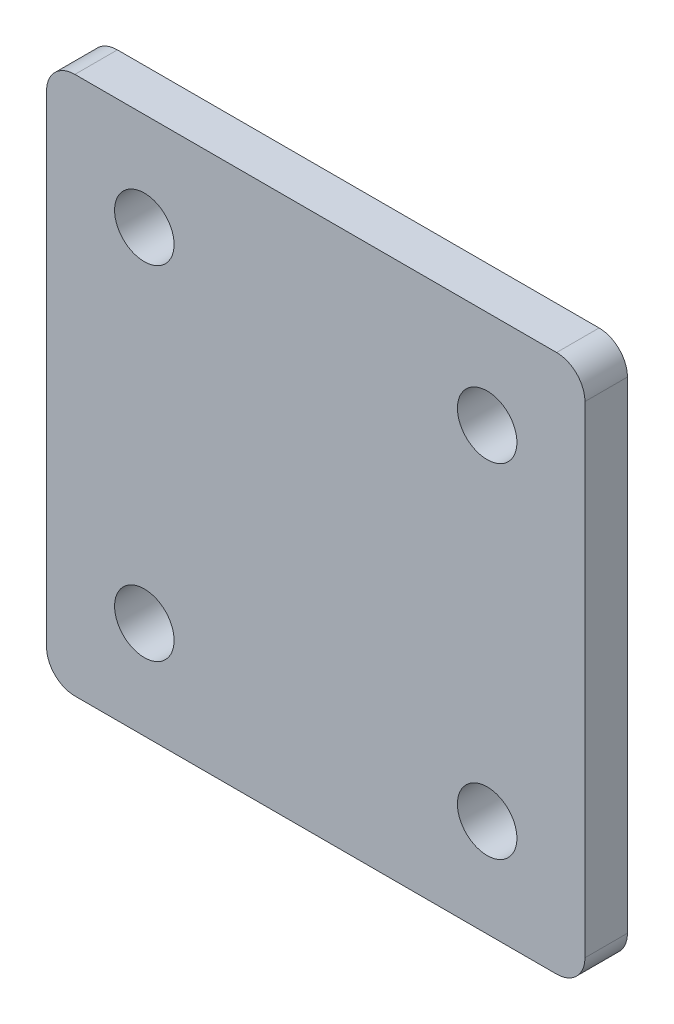
ISO-10303-21;
HEADER;
FILE_DESCRIPTION(('STEP AP214'),'2;1');
FILE_NAME('part.step','',(''),(''),'','','');
FILE_SCHEMA(('AUTOMOTIVE_DESIGN { 1 0 10303 214 1 1 1 1 }'));
ENDSEC;
DATA;
#1=APPLICATION_CONTEXT('core data for automotive mechanical design processes');
#2=APPLICATION_PROTOCOL_DEFINITION('international standard','automotive_design',2000,#1);
#3=PRODUCT_CONTEXT('',#1,'mechanical');
#4=PRODUCT('Part','Part','',(#3));
#5=PRODUCT_RELATED_PRODUCT_CATEGORY('part','',(#4));
#6=PRODUCT_DEFINITION_FORMATION('','',#4);
#7=PRODUCT_DEFINITION_CONTEXT('part definition',#1,'design');
#8=PRODUCT_DEFINITION('design','',#6,#7);
#9=PRODUCT_DEFINITION_SHAPE('','',#8);
#10=(LENGTH_UNIT() NAMED_UNIT(*) SI_UNIT(.MILLI.,.METRE.));
#11=(NAMED_UNIT(*) PLANE_ANGLE_UNIT() SI_UNIT($,.RADIAN.));
#12=(NAMED_UNIT(*) SI_UNIT($,.STERADIAN.) SOLID_ANGLE_UNIT());
#13=UNCERTAINTY_MEASURE_WITH_UNIT(LENGTH_MEASURE(1.E-05),#10,'distance_accuracy_value','');
#14=(GEOMETRIC_REPRESENTATION_CONTEXT(3) GLOBAL_UNCERTAINTY_ASSIGNED_CONTEXT((#13)) GLOBAL_UNIT_ASSIGNED_CONTEXT((#10,
#11,#12)) REPRESENTATION_CONTEXT('',''));
#15=CARTESIAN_POINT('',(0.,0.,0.));
#16=DIRECTION('',(0.,0.,1.));
#17=DIRECTION('',(1.,0.,0.));
#18=AXIS2_PLACEMENT_3D('',#15,#16,#17);
#19=CARTESIAN_POINT('',(95.0000000000001,-94.9999999999997,15.));
#20=DIRECTION('',(1.,0.,0.));
#21=DIRECTION('',(0.,1.,0.));
#22=AXIS2_PLACEMENT_3D('',#19,#20,#21);
#23=PLANE('',#22);
#24=DIRECTION('',(0.,0.,1.00000000000002));
#25=VECTOR('',#24,1.);
#26=CARTESIAN_POINT('',(95.0000000000001,-84.9999999999997,15.));
#27=LINE('',#26,#25);
#28=CARTESIAN_POINT('',(95.0000000000001,-85.0000000000037,1.37794281114435E-12));
#29=VERTEX_POINT('',#28);
#30=CARTESIAN_POINT('',(95.0000000000001,-84.9999999999997,15.));
#31=VERTEX_POINT('',#30);
#32=EDGE_CURVE('E11',#29,#31,#27,.T.);
#33=ORIENTED_EDGE('',*,*,#32,.F.);
#34=DIRECTION('',(0.,1.00000000000002,0.));
#35=VECTOR('',#34,1.);
#36=CARTESIAN_POINT('',(95.0000000000001,0.,-2.40484803003026E-13));
#37=LINE('',#36,#35);
#38=CARTESIAN_POINT('',(95.,85.0000000000037,-1.8589124171504E-12));
#39=VERTEX_POINT('',#38);
#40=EDGE_CURVE('E106',#29,#39,#37,.T.);
#41=ORIENTED_EDGE('',*,*,#40,.T.);
#42=DIRECTION('',(0.,0.,1.00000000000002));
#43=VECTOR('',#42,1.);
#44=CARTESIAN_POINT('',(95.,85.0000000000003,15.));
#45=LINE('',#44,#43);
#46=CARTESIAN_POINT('',(95.,85.0000000000003,15.));
#47=VERTEX_POINT('',#46);
#48=EDGE_CURVE('E47',#39,#47,#45,.T.);
#49=ORIENTED_EDGE('',*,*,#48,.T.);
#50=DIRECTION('',(0.,1.,0.));
#51=VECTOR('',#50,1.);
#52=CARTESIAN_POINT('',(95.0000000000001,-94.9999999999997,15.));
#53=LINE('',#52,#51);
#54=EDGE_CURVE('E154',#31,#47,#53,.T.);
#55=ORIENTED_EDGE('',*,*,#54,.F.);
#56=EDGE_LOOP('',(#33,#41,#49,#55));
#57=FACE_BOUND('',#56,.T.);
#58=ADVANCED_FACE('F37',(#57),#23,.T.);
#59=CARTESIAN_POINT('',(85.0000000000001,85.0000000000003,15.));
#60=DIRECTION('',(0.,0.,1.00000000000002));
#61=DIRECTION('',(0.,-1.,0.));
#62=AXIS2_PLACEMENT_3D('',#59,#60,#61);
#63=CYLINDRICAL_SURFACE('',#62,10.);
#64=ORIENTED_EDGE('',*,*,#48,.F.);
#65=CARTESIAN_POINT('',(85.0000000000001,85.,-9.5062846483529E-13));
#66=DIRECTION('',(0.,0.,1.00000000000002));
#67=DIRECTION('',(0.,-1.,0.));
#68=AXIS2_PLACEMENT_3D('',#65,#66,#67);
#69=CIRCLE('',#68,10.);
#70=CARTESIAN_POINT('',(85.0000000000001,95.0000000000041,-2.05686992089181E-12));
#71=VERTEX_POINT('',#70);
#72=EDGE_CURVE('E128',#39,#71,#69,.T.);
#73=ORIENTED_EDGE('',*,*,#72,.T.);
#74=DIRECTION('',(0.,0.,1.00000000000002));
#75=VECTOR('',#74,1.);
#76=CARTESIAN_POINT('',(85.0000000000001,95.0000000000003,15.0000000000055));
#77=LINE('',#76,#75);
#78=CARTESIAN_POINT('',(85.0000000000001,95.0000000000003,15.0000000000055));
#79=VERTEX_POINT('',#78);
#80=EDGE_CURVE('E147',#71,#79,#77,.T.);
#81=ORIENTED_EDGE('',*,*,#80,.T.);
#82=CARTESIAN_POINT('',(85.0000000000001,85.0000000000003,15.));
#83=DIRECTION('',(0.,0.,1.00000000000002));
#84=DIRECTION('',(1.,0.,0.));
#85=AXIS2_PLACEMENT_3D('',#82,#83,#84);
#86=CIRCLE('',#85,10.);
#87=EDGE_CURVE('E164',#47,#79,#86,.T.);
#88=ORIENTED_EDGE('',*,*,#87,.F.);
#89=EDGE_LOOP('',(#64,#73,#81,#88));
#90=FACE_BOUND('',#89,.T.);
#91=ADVANCED_FACE('F167',(#90),#63,.T.);
#92=CARTESIAN_POINT('',(95.,95.0000000000003,15.0000000000055));
#93=DIRECTION('',(0.,1.,0.));
#94=DIRECTION('',(-1.,0.,0.));
#95=AXIS2_PLACEMENT_3D('',#92,#93,#94);
#96=PLANE('',#95);
#97=ORIENTED_EDGE('',*,*,#80,.F.);
#98=DIRECTION('',(1.,0.,0.));
#99=VECTOR('',#98,1.);
#100=CARTESIAN_POINT('',(0.,95.0000000000041,-2.12108108854642E-12));
#101=LINE('',#100,#99);
#102=CARTESIAN_POINT('',(-85.,95.0000000000041,-2.18529225620103E-12));
#103=VERTEX_POINT('',#102);
#104=EDGE_CURVE('E125',#71,#103,#101,.F.);
#105=ORIENTED_EDGE('',*,*,#104,.T.);
#106=DIRECTION('',(0.,0.,1.00000000000002));
#107=VECTOR('',#106,1.);
#108=CARTESIAN_POINT('',(-85.,95.0000000000003,15.0000000000055));
#109=LINE('',#108,#107);
#110=CARTESIAN_POINT('',(-85.,95.0000000000003,15.0000000000055));
#111=VERTEX_POINT('',#110);
#112=EDGE_CURVE('E144',#103,#111,#109,.T.);
#113=ORIENTED_EDGE('',*,*,#112,.T.);
#114=DIRECTION('',(-1.,0.,0.));
#115=VECTOR('',#114,1.);
#116=CARTESIAN_POINT('',(95.,95.0000000000003,15.0000000000055));
#117=LINE('',#116,#115);
#118=EDGE_CURVE('E168',#79,#111,#117,.T.);
#119=ORIENTED_EDGE('',*,*,#118,.F.);
#120=EDGE_LOOP('',(#97,#105,#113,#119));
#121=FACE_BOUND('',#120,.T.);
#122=ADVANCED_FACE('F212',(#121),#96,.T.);
#123=CARTESIAN_POINT('',(-85.,85.0000000000003,15.));
#124=DIRECTION('',(0.,0.,1.00000000000002));
#125=DIRECTION('',(0.,-1.,0.));
#126=AXIS2_PLACEMENT_3D('',#123,#124,#125);
#127=CYLINDRICAL_SURFACE('',#126,10.);
#128=ORIENTED_EDGE('',*,*,#112,.F.);
#129=CARTESIAN_POINT('',(-85.,85.,-9.5062846483529E-13));
#130=DIRECTION('',(0.,0.,1.00000000000002));
#131=DIRECTION('',(0.,-1.,0.));
#132=AXIS2_PLACEMENT_3D('',#129,#130,#131);
#133=CIRCLE('',#132,10.);
#134=CARTESIAN_POINT('',(-95.,85.0000000000037,-2.002443262496E-12));
#135=VERTEX_POINT('',#134);
#136=EDGE_CURVE('E122',#103,#135,#133,.T.);
#137=ORIENTED_EDGE('',*,*,#136,.T.);
#138=DIRECTION('',(0.,0.,1.00000000000002));
#139=VECTOR('',#138,1.);
#140=CARTESIAN_POINT('',(-95.,85.0000000000003,15.));
#141=LINE('',#140,#139);
#142=CARTESIAN_POINT('',(-95.,85.0000000000003,15.));
#143=VERTEX_POINT('',#142);
#144=EDGE_CURVE('E141',#135,#143,#141,.T.);
#145=ORIENTED_EDGE('',*,*,#144,.T.);
#146=CARTESIAN_POINT('',(-85.,85.0000000000003,15.));
#147=DIRECTION('',(0.,0.,1.00000000000002));
#148=DIRECTION('',(1.,0.,0.));
#149=AXIS2_PLACEMENT_3D('',#146,#147,#148);
#150=CIRCLE('',#149,10.);
#151=EDGE_CURVE('E170',#111,#143,#150,.T.);
#152=ORIENTED_EDGE('',*,*,#151,.F.);
#153=EDGE_LOOP('',(#128,#137,#145,#152));
#154=FACE_BOUND('',#153,.T.);
#155=ADVANCED_FACE('F257',(#154),#127,.T.);
#156=CARTESIAN_POINT('',(-95.,-94.9999999999997,15.));
#157=DIRECTION('',(-1.,0.,0.));
#158=DIRECTION('',(0.,-1.,0.));
#159=AXIS2_PLACEMENT_3D('',#156,#157,#158);
#160=PLANE('',#159);
#161=ORIENTED_EDGE('',*,*,#144,.F.);
#162=DIRECTION('',(0.,1.00000000000002,0.));
#163=VECTOR('',#162,1.);
#164=CARTESIAN_POINT('',(-95.,0.,-3.84015648348624E-13));
#165=LINE('',#164,#163);
#166=CARTESIAN_POINT('',(-95.,-85.0000000000037,1.23441196579875E-12));
#167=VERTEX_POINT('',#166);
#168=EDGE_CURVE('E119',#135,#167,#165,.F.);
#169=ORIENTED_EDGE('',*,*,#168,.T.);
#170=DIRECTION('',(0.,0.,1.00000000000002));
#171=VECTOR('',#170,1.);
#172=CARTESIAN_POINT('',(-95.,-84.9999999999998,15.));
#173=LINE('',#172,#171);
#174=CARTESIAN_POINT('',(-95.,-84.9999999999998,15.));
#175=VERTEX_POINT('',#174);
#176=EDGE_CURVE('E139',#167,#175,#173,.T.);
#177=ORIENTED_EDGE('',*,*,#176,.T.);
#178=DIRECTION('',(0.,-1.,0.));
#179=VECTOR('',#178,1.);
#180=CARTESIAN_POINT('',(-95.,-94.9999999999997,15.));
#181=LINE('',#180,#179);
#182=EDGE_CURVE('E176',#143,#175,#181,.T.);
#183=ORIENTED_EDGE('',*,*,#182,.F.);
#184=EDGE_LOOP('',(#161,#169,#177,#183));
#185=FACE_BOUND('',#184,.T.);
#186=ADVANCED_FACE('F262',(#185),#160,.T.);
#187=CARTESIAN_POINT('',(-85.,-84.9999999999998,15.));
#188=DIRECTION('',(0.,0.,1.00000000000002));
#189=DIRECTION('',(0.,-1.,0.));
#190=AXIS2_PLACEMENT_3D('',#187,#188,#189);
#191=CYLINDRICAL_SURFACE('',#190,10.);
#192=ORIENTED_EDGE('',*,*,#176,.F.);
#193=CARTESIAN_POINT('',(-85.,-85.0000000000001,-9.80118763926896E-13));
#194=DIRECTION('',(0.,0.,1.00000000000002));
#195=DIRECTION('',(0.,-1.,0.));
#196=AXIS2_PLACEMENT_3D('',#193,#194,#195);
#197=CIRCLE('',#196,10.);
#198=CARTESIAN_POINT('',(-85.,-95.0000000000042,1.43236946954016E-12));
#199=VERTEX_POINT('',#198);
#200=EDGE_CURVE('E116',#167,#199,#197,.T.);
#201=ORIENTED_EDGE('',*,*,#200,.T.);
#202=DIRECTION('',(0.,0.,1.00000000000002));
#203=VECTOR('',#202,1.);
#204=CARTESIAN_POINT('',(-85.,-94.9999999999997,15.));
#205=LINE('',#204,#203);
#206=CARTESIAN_POINT('',(-85.,-94.9999999999997,15.));
#207=VERTEX_POINT('',#206);
#208=EDGE_CURVE('E55',#199,#207,#205,.T.);
#209=ORIENTED_EDGE('',*,*,#208,.T.);
#210=CARTESIAN_POINT('',(-85.,-84.9999999999998,15.));
#211=DIRECTION('',(0.,0.,1.00000000000002));
#212=DIRECTION('',(1.,0.,0.));
#213=AXIS2_PLACEMENT_3D('',#210,#211,#212);
#214=CIRCLE('',#213,10.);
#215=EDGE_CURVE('E179',#175,#207,#214,.T.);
#216=ORIENTED_EDGE('',*,*,#215,.F.);
#217=EDGE_LOOP('',(#192,#201,#209,#216));
#218=FACE_BOUND('',#217,.T.);
#219=ADVANCED_FACE('F202',(#218),#191,.T.);
#220=CARTESIAN_POINT('',(95.0000000000001,-94.9999999999997,15.));
#221=DIRECTION('',(0.,-1.,0.));
#222=DIRECTION('',(1.,0.,0.));
#223=AXIS2_PLACEMENT_3D('',#220,#221,#222);
#224=PLANE('',#223);
#225=ORIENTED_EDGE('',*,*,#208,.F.);
#226=DIRECTION('',(1.,0.,0.));
#227=VECTOR('',#226,1.);
#228=CARTESIAN_POINT('',(0.,-95.0000000000042,1.49658063719477E-12));
#229=LINE('',#228,#227);
#230=CARTESIAN_POINT('',(85.0000000000001,-95.0000000000041,1.56079180484938E-12));
#231=VERTEX_POINT('',#230);
#232=EDGE_CURVE('E104',#199,#231,#229,.T.);
#233=ORIENTED_EDGE('',*,*,#232,.T.);
#234=DIRECTION('',(0.,0.,1.00000000000002));
#235=VECTOR('',#234,1.);
#236=CARTESIAN_POINT('',(85.0000000000001,-94.9999999999997,15.));
#237=LINE('',#236,#235);
#238=CARTESIAN_POINT('',(85.0000000000001,-94.9999999999997,15.));
#239=VERTEX_POINT('',#238);
#240=EDGE_CURVE('E41',#231,#239,#237,.T.);
#241=ORIENTED_EDGE('',*,*,#240,.T.);
#242=DIRECTION('',(1.,0.,0.));
#243=VECTOR('',#242,1.);
#244=CARTESIAN_POINT('',(95.0000000000001,-94.9999999999997,15.));
#245=LINE('',#244,#243);
#246=EDGE_CURVE('E246',#207,#239,#245,.T.);
#247=ORIENTED_EDGE('',*,*,#246,.F.);
#248=EDGE_LOOP('',(#225,#233,#241,#247));
#249=FACE_BOUND('',#248,.T.);
#250=ADVANCED_FACE('F108',(#249),#224,.T.);
#251=CARTESIAN_POINT('',(60.5000000000002,-60.4999999999993,15.));
#252=DIRECTION('',(0.,0.,1.00000000000002));
#253=DIRECTION('',(0.,-1.,0.));
#254=AXIS2_PLACEMENT_3D('',#251,#252,#253);
#255=CYLINDRICAL_SURFACE('',#254,10.5);
#256=CARTESIAN_POINT('',(60.5000000000002,-60.4999999999993,15.));
#257=DIRECTION('',(0.,0.,1.00000000000002));
#258=DIRECTION('',(1.,0.,0.));
#259=AXIS2_PLACEMENT_3D('',#256,#257,#258);
#260=CIRCLE('',#259,10.5);
#261=CARTESIAN_POINT('',(71.0000000000002,-60.4999999999993,15.));
#262=VERTEX_POINT('',#261);
#263=EDGE_CURVE('E137',#262,#262,#260,.T.);
#264=ORIENTED_EDGE('',*,*,#263,.T.);
#265=EDGE_LOOP('',(#264));
#266=FACE_BOUND('',#265,.T.);
#267=CARTESIAN_POINT('',(60.5000000000002,-60.4999999999995,-9.74914593498966E-13));
#268=DIRECTION('',(0.,0.,1.00000000000002));
#269=DIRECTION('',(0.,-1.,0.));
#270=AXIS2_PLACEMENT_3D('',#267,#268,#269);
#271=CIRCLE('',#270,10.5);
#272=CARTESIAN_POINT('',(60.5000000000002,-70.9999999999995,-7.74991182339593E-13));
#273=VERTEX_POINT('',#272);
#274=EDGE_CURVE('E112',#273,#273,#271,.T.);
#275=ORIENTED_EDGE('',*,*,#274,.F.);
#276=EDGE_LOOP('',(#275));
#277=FACE_BOUND('',#276,.T.);
#278=ADVANCED_FACE('F191',(#266,#277),#255,.F.);
#279=CARTESIAN_POINT('',(-60.5,60.5,15.0000000000055));
#280=DIRECTION('',(0.,0.,1.00000000000002));
#281=DIRECTION('',(0.,-1.,0.));
#282=AXIS2_PLACEMENT_3D('',#279,#280,#281);
#283=CYLINDRICAL_SURFACE('',#282,10.5);
#284=CARTESIAN_POINT('',(-60.5,60.5,15.0000000000055));
#285=DIRECTION('',(0.,0.,1.00000000000002));
#286=DIRECTION('',(1.,0.,0.));
#287=AXIS2_PLACEMENT_3D('',#284,#285,#286);
#288=CIRCLE('',#287,10.5);
#289=CARTESIAN_POINT('',(-50.,60.5,15.0000000000055));
#290=VERTEX_POINT('',#289);
#291=EDGE_CURVE('E245',#290,#290,#288,.T.);
#292=ORIENTED_EDGE('',*,*,#291,.T.);
#293=EDGE_LOOP('',(#292));
#294=FACE_BOUND('',#293,.T.);
#295=CARTESIAN_POINT('',(-60.5,60.4999999999997,4.48599490887602E-12));
#296=DIRECTION('',(0.,0.,1.00000000000002));
#297=DIRECTION('',(0.,-1.,0.));
#298=AXIS2_PLACEMENT_3D('',#295,#296,#297);
#299=CIRCLE('',#298,10.5);
#300=CARTESIAN_POINT('',(-60.5,49.9999999999997,4.6859183200354E-12));
#301=VERTEX_POINT('',#300);
#302=EDGE_CURVE('E109',#301,#301,#299,.T.);
#303=ORIENTED_EDGE('',*,*,#302,.F.);
#304=EDGE_LOOP('',(#303));
#305=FACE_BOUND('',#304,.T.);
#306=ADVANCED_FACE('F193',(#294,#305),#283,.F.);
#307=CARTESIAN_POINT('',(85.0000000000001,-84.9999999999997,15.));
#308=DIRECTION('',(0.,0.,1.00000000000002));
#309=DIRECTION('',(0.,-1.,0.));
#310=AXIS2_PLACEMENT_3D('',#307,#308,#309);
#311=CYLINDRICAL_SURFACE('',#310,10.);
#312=CARTESIAN_POINT('',(85.0000000000001,-85.,-9.80118763926896E-13));
#313=DIRECTION('',(0.,0.,1.00000000000002));
#314=DIRECTION('',(0.,-1.,0.));
#315=AXIS2_PLACEMENT_3D('',#312,#313,#314);
#316=CIRCLE('',#315,10.);
#317=EDGE_CURVE('E92',#231,#29,#316,.T.);
#318=ORIENTED_EDGE('',*,*,#317,.T.);
#319=ORIENTED_EDGE('',*,*,#32,.T.);
#320=CARTESIAN_POINT('',(85.0000000000001,-84.9999999999997,15.));
#321=DIRECTION('',(0.,0.,1.00000000000002));
#322=DIRECTION('',(1.,0.,0.));
#323=AXIS2_PLACEMENT_3D('',#320,#321,#322);
#324=CIRCLE('',#323,10.);
#325=EDGE_CURVE('E94',#239,#31,#324,.T.);
#326=ORIENTED_EDGE('',*,*,#325,.F.);
#327=ORIENTED_EDGE('',*,*,#240,.F.);
#328=EDGE_LOOP('',(#318,#319,#326,#327));
#329=FACE_BOUND('',#328,.T.);
#330=ADVANCED_FACE('F91',(#329),#311,.T.);
#331=CARTESIAN_POINT('',(60.5,60.5000000000004,15.0000000000055));
#332=DIRECTION('',(0.,0.,1.00000000000002));
#333=DIRECTION('',(0.,-1.,0.));
#334=AXIS2_PLACEMENT_3D('',#331,#332,#333);
#335=CYLINDRICAL_SURFACE('',#334,10.5);
#336=CARTESIAN_POINT('',(60.5,60.5000000000004,15.0000000000055));
#337=DIRECTION('',(0.,0.,1.00000000000002));
#338=DIRECTION('',(1.,0.,0.));
#339=AXIS2_PLACEMENT_3D('',#336,#337,#338);
#340=CIRCLE('',#339,10.5);
#341=CARTESIAN_POINT('',(71.,60.5000000000004,15.0000000000055));
#342=VERTEX_POINT('',#341);
#343=EDGE_CURVE('E182',#342,#342,#340,.T.);
#344=ORIENTED_EDGE('',*,*,#343,.T.);
#345=EDGE_LOOP('',(#344));
#346=FACE_BOUND('',#345,.T.);
#347=CARTESIAN_POINT('',(60.5,60.5000000000001,4.48426018540005E-12));
#348=DIRECTION('',(0.,0.,1.00000000000002));
#349=DIRECTION('',(0.,-1.,0.));
#350=AXIS2_PLACEMENT_3D('',#347,#348,#349);
#351=CIRCLE('',#350,10.5);
#352=CARTESIAN_POINT('',(60.5,50.0000000000001,4.68418359655942E-12));
#353=VERTEX_POINT('',#352);
#354=EDGE_CURVE('E118',#353,#353,#351,.T.);
#355=ORIENTED_EDGE('',*,*,#354,.F.);
#356=EDGE_LOOP('',(#355));
#357=FACE_BOUND('',#356,.T.);
#358=ADVANCED_FACE('F217',(#346,#357),#335,.F.);
#359=CARTESIAN_POINT('',(-60.4999999999998,-60.4999999999998,15.));
#360=DIRECTION('',(0.,0.,1.00000000000002));
#361=DIRECTION('',(0.,-1.,0.));
#362=AXIS2_PLACEMENT_3D('',#359,#360,#361);
#363=CYLINDRICAL_SURFACE('',#362,10.5);
#364=CARTESIAN_POINT('',(-60.4999999999998,-60.4999999999998,15.));
#365=DIRECTION('',(0.,0.,1.00000000000002));
#366=DIRECTION('',(1.,0.,0.));
#367=AXIS2_PLACEMENT_3D('',#364,#365,#366);
#368=CIRCLE('',#367,10.5);
#369=CARTESIAN_POINT('',(-49.9999999999998,-60.4999999999998,15.));
#370=VERTEX_POINT('',#369);
#371=EDGE_CURVE('E98',#370,#370,#368,.T.);
#372=ORIENTED_EDGE('',*,*,#371,.T.);
#373=EDGE_LOOP('',(#372));
#374=FACE_BOUND('',#373,.T.);
#375=CARTESIAN_POINT('',(-60.4999999999998,-60.5000000000001,-9.74914593498966E-13));
#376=DIRECTION('',(0.,0.,1.00000000000002));
#377=DIRECTION('',(0.,-1.,0.));
#378=AXIS2_PLACEMENT_3D('',#375,#376,#377);
#379=CIRCLE('',#378,10.5);
#380=CARTESIAN_POINT('',(-60.4999999999998,-71.0000000000001,-7.74991182339593E-13));
#381=VERTEX_POINT('',#380);
#382=EDGE_CURVE('E134',#381,#381,#379,.T.);
#383=ORIENTED_EDGE('',*,*,#382,.F.);
#384=EDGE_LOOP('',(#383));
#385=FACE_BOUND('',#384,.T.);
#386=ADVANCED_FACE('F39',(#374,#385),#363,.F.);
#387=CARTESIAN_POINT('',(0.,3.40005801291454E-13,15.));
#388=DIRECTION('',(0.,0.,1.00000000000002));
#389=DIRECTION('',(1.,0.,0.));
#390=AXIS2_PLACEMENT_3D('',#387,#388,#389);
#391=PLANE('',#390);
#392=ORIENTED_EDGE('',*,*,#263,.F.);
#393=EDGE_LOOP('',(#392));
#394=FACE_BOUND('',#393,.T.);
#395=ORIENTED_EDGE('',*,*,#291,.F.);
#396=EDGE_LOOP('',(#395));
#397=FACE_BOUND('',#396,.T.);
#398=ORIENTED_EDGE('',*,*,#246,.T.);
#399=ORIENTED_EDGE('',*,*,#325,.T.);
#400=ORIENTED_EDGE('',*,*,#54,.T.);
#401=ORIENTED_EDGE('',*,*,#87,.T.);
#402=ORIENTED_EDGE('',*,*,#118,.T.);
#403=ORIENTED_EDGE('',*,*,#151,.T.);
#404=ORIENTED_EDGE('',*,*,#182,.T.);
#405=ORIENTED_EDGE('',*,*,#215,.T.);
#406=EDGE_LOOP('',(#398,#399,#400,#401,#402,#403,#404,#405));
#407=FACE_BOUND('',#406,.T.);
#408=ORIENTED_EDGE('',*,*,#343,.F.);
#409=EDGE_LOOP('',(#408));
#410=FACE_BOUND('',#409,.T.);
#411=ORIENTED_EDGE('',*,*,#371,.F.);
#412=EDGE_LOOP('',(#411));
#413=FACE_BOUND('',#412,.T.);
#414=ADVANCED_FACE('F161',(#394,#397,#407,#410,#413),#391,.T.);
#415=CARTESIAN_POINT('',(0.,0.,-3.12250225675825E-13));
#416=DIRECTION('',(0.,0.,1.00000000000002));
#417=DIRECTION('',(1.,0.,0.));
#418=AXIS2_PLACEMENT_3D('',#415,#416,#417);
#419=PLANE('',#418);
#420=ORIENTED_EDGE('',*,*,#274,.T.);
#421=EDGE_LOOP('',(#420));
#422=FACE_BOUND('',#421,.T.);
#423=ORIENTED_EDGE('',*,*,#302,.T.);
#424=EDGE_LOOP('',(#423));
#425=FACE_BOUND('',#424,.T.);
#426=ORIENTED_EDGE('',*,*,#232,.F.);
#427=ORIENTED_EDGE('',*,*,#200,.F.);
#428=ORIENTED_EDGE('',*,*,#168,.F.);
#429=ORIENTED_EDGE('',*,*,#136,.F.);
#430=ORIENTED_EDGE('',*,*,#104,.F.);
#431=ORIENTED_EDGE('',*,*,#72,.F.);
#432=ORIENTED_EDGE('',*,*,#40,.F.);
#433=ORIENTED_EDGE('',*,*,#317,.F.);
#434=EDGE_LOOP('',(#426,#427,#428,#429,#430,#431,#432,#433));
#435=FACE_BOUND('',#434,.T.);
#436=ORIENTED_EDGE('',*,*,#354,.T.);
#437=EDGE_LOOP('',(#436));
#438=FACE_BOUND('',#437,.T.);
#439=ORIENTED_EDGE('',*,*,#382,.T.);
#440=EDGE_LOOP('',(#439));
#441=FACE_BOUND('',#440,.T.);
#442=ADVANCED_FACE('F101',(#422,#425,#435,#438,#441),#419,.F.);
#443=CLOSED_SHELL('',(#58,#91,#122,#155,#186,#219,#250,#278,#306,#330,#358,#386,#414,#442));
#444=MANIFOLD_SOLID_BREP('B2',#443);
#445=ADVANCED_BREP_SHAPE_REPRESENTATION('',(#18,#444),#14);
#446=SHAPE_DEFINITION_REPRESENTATION(#9,#445);
ENDSEC;
END-ISO-10303-21;
